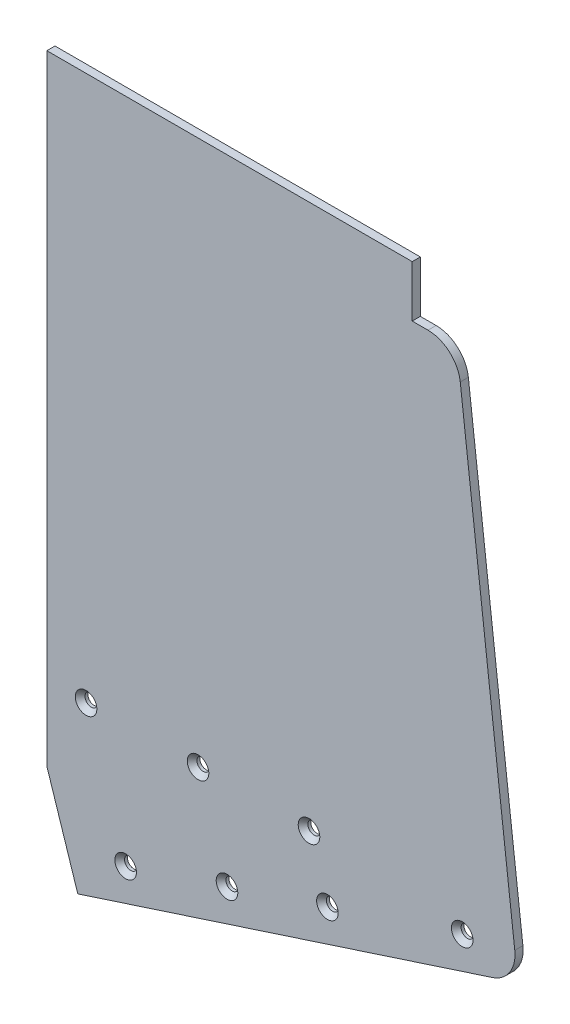
ISO-10303-21;
HEADER;
FILE_DESCRIPTION(('STEP AP214'),'2;1');
FILE_NAME('part.step','',(''),(''),'','','');
FILE_SCHEMA(('AUTOMOTIVE_DESIGN { 1 0 10303 214 1 1 1 1 }'));
ENDSEC;
DATA;
#1=APPLICATION_CONTEXT('core data for automotive mechanical design processes');
#2=APPLICATION_PROTOCOL_DEFINITION('international standard','automotive_design',2000,#1);
#3=PRODUCT_CONTEXT('',#1,'mechanical');
#4=PRODUCT('Part','Part','',(#3));
#5=PRODUCT_RELATED_PRODUCT_CATEGORY('part','',(#4));
#6=PRODUCT_DEFINITION_FORMATION('','',#4);
#7=PRODUCT_DEFINITION_CONTEXT('part definition',#1,'design');
#8=PRODUCT_DEFINITION('design','',#6,#7);
#9=PRODUCT_DEFINITION_SHAPE('','',#8);
#10=(LENGTH_UNIT() NAMED_UNIT(*) SI_UNIT(.MILLI.,.METRE.));
#11=(NAMED_UNIT(*) PLANE_ANGLE_UNIT() SI_UNIT($,.RADIAN.));
#12=(NAMED_UNIT(*) SI_UNIT($,.STERADIAN.) SOLID_ANGLE_UNIT());
#13=UNCERTAINTY_MEASURE_WITH_UNIT(LENGTH_MEASURE(1.E-05),#10,'distance_accuracy_value','');
#14=(GEOMETRIC_REPRESENTATION_CONTEXT(3) GLOBAL_UNCERTAINTY_ASSIGNED_CONTEXT((#13)) GLOBAL_UNIT_ASSIGNED_CONTEXT((#10,
#11,#12)) REPRESENTATION_CONTEXT('',''));
#15=CARTESIAN_POINT('',(0.,0.,0.));
#16=DIRECTION('',(0.,0.,1.));
#17=DIRECTION('',(1.,0.,0.));
#18=AXIS2_PLACEMENT_3D('',#15,#16,#17);
#19=CARTESIAN_POINT('',(-234.75296718065,12.6999999999999,-3.17499999999976));
#20=DIRECTION('',(1.,0.,0.));
#21=DIRECTION('',(0.,1.,0.));
#22=AXIS2_PLACEMENT_3D('',#19,#20,#21);
#23=PLANE('',#22);
#24=DIRECTION('',(0.,-1.,0.));
#25=VECTOR('',#24,1.);
#26=CARTESIAN_POINT('',(-234.75296718065,12.6999999999999,3.33066907387547E-13));
#27=LINE('',#26,#25);
#28=CARTESIAN_POINT('',(-234.75296718065,12.6999999999999,3.33066907387547E-13));
#29=VERTEX_POINT('',#28);
#30=CARTESIAN_POINT('',(-234.75296718065,-229.485553097579,1.66533453693773E-13));
#31=VERTEX_POINT('',#30);
#32=EDGE_CURVE('E120',#29,#31,#27,.T.);
#33=ORIENTED_EDGE('',*,*,#32,.F.);
#34=DIRECTION('',(0.,0.,1.));
#35=VECTOR('',#34,1.);
#36=CARTESIAN_POINT('',(-234.75296718065,12.6999999999999,-3.17499999999976));
#37=LINE('',#36,#35);
#38=CARTESIAN_POINT('',(-234.75296718065,12.6999999999999,-3.17499999999976));
#39=VERTEX_POINT('',#38);
#40=EDGE_CURVE('E147',#39,#29,#37,.T.);
#41=ORIENTED_EDGE('',*,*,#40,.F.);
#42=DIRECTION('',(0.,-1.,0.));
#43=VECTOR('',#42,1.);
#44=CARTESIAN_POINT('',(-234.75296718065,12.6999999999999,-3.17499999999976));
#45=LINE('',#44,#43);
#46=CARTESIAN_POINT('',(-234.75296718065,-229.485553097579,-3.17499999999987));
#47=VERTEX_POINT('',#46);
#48=EDGE_CURVE('E146',#39,#47,#45,.T.);
#49=ORIENTED_EDGE('',*,*,#48,.T.);
#50=DIRECTION('',(0.,0.,-1.));
#51=VECTOR('',#50,1.);
#52=CARTESIAN_POINT('',(-234.75296718065,-229.485553097579,1.66533453693773E-13));
#53=LINE('',#52,#51);
#54=EDGE_CURVE('E128',#31,#47,#53,.T.);
#55=ORIENTED_EDGE('',*,*,#54,.F.);
#56=EDGE_LOOP('',(#33,#41,#49,#55));
#57=FACE_BOUND('',#56,.T.);
#58=ADVANCED_FACE('F43',(#57),#23,.F.);
#59=CARTESIAN_POINT('',(-234.75296718065,-270.542758327657,-3.17499999999993));
#60=DIRECTION('',(-0.309324512684967,0.950956542567645,0.));
#61=DIRECTION('',(-0.950956542567645,-0.309324512684967,0.));
#62=AXIS2_PLACEMENT_3D('',#59,#60,#61);
#63=PLANE('',#62);
#64=DIRECTION('',(0.950956542567645,0.309324512684967,0.));
#65=VECTOR('',#64,1.);
#66=CARTESIAN_POINT('',(-234.75296718065,-270.542758327657,-3.17499999999993));
#67=LINE('',#66,#65);
#68=CARTESIAN_POINT('',(-222.675819090041,-266.614337016557,-3.17499999999987));
#69=VERTEX_POINT('',#68);
#70=CARTESIAN_POINT('',(-60.5974720840385,-213.893940804708,-3.17500000000004));
#71=VERTEX_POINT('',#70);
#72=EDGE_CURVE('E189',#69,#71,#67,.T.);
#73=ORIENTED_EDGE('',*,*,#72,.T.);
#74=DIRECTION('',(0.,0.,1.));
#75=VECTOR('',#74,1.);
#76=CARTESIAN_POINT('',(-60.5974720840385,-213.893940804708,-3.17500000000004));
#77=LINE('',#76,#75);
#78=CARTESIAN_POINT('',(-60.5974720840384,-213.893940804708,0.));
#79=VERTEX_POINT('',#78);
#80=EDGE_CURVE('E11',#79,#71,#77,.F.);
#81=ORIENTED_EDGE('',*,*,#80,.F.);
#82=DIRECTION('',(0.950956542567645,0.309324512684967,0.));
#83=VECTOR('',#82,1.);
#84=CARTESIAN_POINT('',(-234.75296718065,-270.542758327656,0.));
#85=LINE('',#84,#83);
#86=CARTESIAN_POINT('',(-222.675819090041,-266.614337016556,1.66533453693773E-13));
#87=VERTEX_POINT('',#86);
#88=EDGE_CURVE('E117',#87,#79,#85,.T.);
#89=ORIENTED_EDGE('',*,*,#88,.F.);
#90=DIRECTION('',(0.,0.,-1.));
#91=VECTOR('',#90,1.);
#92=CARTESIAN_POINT('',(-222.675819090041,-266.614337016556,1.66533453693773E-13));
#93=LINE('',#92,#91);
#94=EDGE_CURVE('E121',#87,#69,#93,.T.);
#95=ORIENTED_EDGE('',*,*,#94,.T.);
#96=EDGE_LOOP('',(#73,#81,#89,#95));
#97=FACE_BOUND('',#96,.T.);
#98=ADVANCED_FACE('F130',(#97),#63,.F.);
#99=CARTESIAN_POINT('',(-74.5334651306729,-7.41697903189298,-3.17499999999993));
#100=DIRECTION('',(-0.993195579602869,-0.11645832154604,0.));
#101=DIRECTION('',(0.11645832154604,-0.993195579602869,0.));
#102=AXIS2_PLACEMENT_3D('',#99,#100,#101);
#103=PLANE('',#102);
#104=DIRECTION('',(-0.11645832154604,0.993195579602869,0.));
#105=VECTOR('',#104,1.);
#106=CARTESIAN_POINT('',(-74.5334651306728,-7.41697903189276,0.));
#107=LINE('',#106,#105);
#108=CARTESIAN_POINT('',(-51.9123095341809,-200.337772030464,1.66533453693773E-13));
#109=VERTEX_POINT('',#108);
#110=CARTESIAN_POINT('',(-73.2177359388357,-18.6379583482588,0.));
#111=VERTEX_POINT('',#110);
#112=EDGE_CURVE('E131',#109,#111,#107,.T.);
#113=ORIENTED_EDGE('',*,*,#112,.F.);
#114=DIRECTION('',(0.,0.,1.));
#115=VECTOR('',#114,1.);
#116=CARTESIAN_POINT('',(-51.9123095341807,-200.337772030465,-3.17499999999982));
#117=LINE('',#116,#115);
#118=CARTESIAN_POINT('',(-51.9123095341807,-200.337772030465,-3.17499999999982));
#119=VERTEX_POINT('',#118);
#120=EDGE_CURVE('E164',#119,#109,#117,.T.);
#121=ORIENTED_EDGE('',*,*,#120,.F.);
#122=DIRECTION('',(-0.11645832154604,0.993195579602869,0.));
#123=VECTOR('',#122,1.);
#124=CARTESIAN_POINT('',(-74.5334651306729,-7.41697903189298,-3.17499999999993));
#125=LINE('',#124,#123);
#126=CARTESIAN_POINT('',(-73.2177359388355,-18.6379583482585,-3.17500000000004));
#127=VERTEX_POINT('',#126);
#128=EDGE_CURVE('E186',#119,#127,#125,.T.);
#129=ORIENTED_EDGE('',*,*,#128,.T.);
#130=DIRECTION('',(0.,0.,1.));
#131=VECTOR('',#130,1.);
#132=CARTESIAN_POINT('',(-73.2177359388355,-18.6379583482585,-3.17500000000004));
#133=LINE('',#132,#131);
#134=EDGE_CURVE('E167',#111,#127,#133,.F.);
#135=ORIENTED_EDGE('',*,*,#134,.F.);
#136=EDGE_LOOP('',(#113,#121,#129,#135));
#137=FACE_BOUND('',#136,.T.);
#138=ADVANCED_FACE('F284',(#137),#103,.F.);
#139=CARTESIAN_POINT('',(-74.5334651306729,-7.41697903189298,-3.17499999999993));
#140=DIRECTION('',(0.,-1.,0.));
#141=DIRECTION('',(1.,0.,0.));
#142=AXIS2_PLACEMENT_3D('',#139,#140,#141);
#143=PLANE('',#142);
#144=DIRECTION('',(-1.,0.,0.));
#145=VECTOR('',#144,1.);
#146=CARTESIAN_POINT('',(-74.5334651306729,-7.41697903189298,-3.17499999999993));
#147=LINE('',#146,#145);
#148=CARTESIAN_POINT('',(-85.8313197997924,-7.41697903189342,-3.17499999999987));
#149=VERTEX_POINT('',#148);
#150=CARTESIAN_POINT('',(-91.9973273926191,-7.41697903189298,-3.17499999999998));
#151=VERTEX_POINT('',#150);
#152=EDGE_CURVE('E180',#149,#151,#147,.T.);
#153=ORIENTED_EDGE('',*,*,#152,.T.);
#154=DIRECTION('',(0.,0.,1.));
#155=VECTOR('',#154,1.);
#156=CARTESIAN_POINT('',(-91.9973273926191,-7.41697903189298,-3.17499999999998));
#157=LINE('',#156,#155);
#158=CARTESIAN_POINT('',(-91.9973273926189,-7.41697903189298,0.));
#159=VERTEX_POINT('',#158);
#160=EDGE_CURVE('E154',#151,#159,#157,.T.);
#161=ORIENTED_EDGE('',*,*,#160,.T.);
#162=DIRECTION('',(-1.,0.,0.));
#163=VECTOR('',#162,1.);
#164=CARTESIAN_POINT('',(-74.5334651306728,-7.41697903189276,0.));
#165=LINE('',#164,#163);
#166=CARTESIAN_POINT('',(-85.8313197997925,-7.41697903189276,1.66533453693773E-13));
#167=VERTEX_POINT('',#166);
#168=EDGE_CURVE('E134',#167,#159,#165,.T.);
#169=ORIENTED_EDGE('',*,*,#168,.F.);
#170=DIRECTION('',(0.,0.,1.));
#171=VECTOR('',#170,1.);
#172=CARTESIAN_POINT('',(-85.8313197997924,-7.41697903189342,-3.17499999999987));
#173=LINE('',#172,#171);
#174=EDGE_CURVE('E157',#149,#167,#173,.T.);
#175=ORIENTED_EDGE('',*,*,#174,.F.);
#176=EDGE_LOOP('',(#153,#161,#169,#175));
#177=FACE_BOUND('',#176,.T.);
#178=ADVANCED_FACE('F179',(#177),#143,.F.);
#179=CARTESIAN_POINT('',(-91.9973273926191,-7.41697903189298,-3.17499999999998));
#180=DIRECTION('',(-1.,0.,0.));
#181=DIRECTION('',(0.,0.,-1.));
#182=AXIS2_PLACEMENT_3D('',#179,#180,#181);
#183=PLANE('',#182);
#184=DIRECTION('',(0.,1.,0.));
#185=VECTOR('',#184,1.);
#186=CARTESIAN_POINT('',(-91.9973273926189,-7.41697903189298,0.));
#187=LINE('',#186,#185);
#188=CARTESIAN_POINT('',(-91.9973273926188,12.6999999999995,1.66533453693773E-13));
#189=VERTEX_POINT('',#188);
#190=EDGE_CURVE('E141',#159,#189,#187,.T.);
#191=ORIENTED_EDGE('',*,*,#190,.F.);
#192=ORIENTED_EDGE('',*,*,#160,.F.);
#193=DIRECTION('',(0.,1.,0.));
#194=VECTOR('',#193,1.);
#195=CARTESIAN_POINT('',(-91.9973273926191,-7.41697903189298,-3.17499999999998));
#196=LINE('',#195,#194);
#197=CARTESIAN_POINT('',(-91.9973273926184,12.6999999999995,-3.17499999999982));
#198=VERTEX_POINT('',#197);
#199=EDGE_CURVE('E184',#151,#198,#196,.T.);
#200=ORIENTED_EDGE('',*,*,#199,.T.);
#201=DIRECTION('',(0.,0.,1.));
#202=VECTOR('',#201,1.);
#203=CARTESIAN_POINT('',(-91.9973273926184,12.6999999999995,-3.17499999999982));
#204=LINE('',#203,#202);
#205=EDGE_CURVE('E150',#198,#189,#204,.T.);
#206=ORIENTED_EDGE('',*,*,#205,.T.);
#207=EDGE_LOOP('',(#191,#192,#200,#206));
#208=FACE_BOUND('',#207,.T.);
#209=ADVANCED_FACE('F303',(#208),#183,.F.);
#210=CARTESIAN_POINT('',(-234.75296718065,12.6999999999999,-3.17499999999976));
#211=DIRECTION('',(0.,-1.,0.));
#212=DIRECTION('',(1.,0.,0.));
#213=AXIS2_PLACEMENT_3D('',#210,#211,#212);
#214=PLANE('',#213);
#215=DIRECTION('',(-1.,0.,0.));
#216=VECTOR('',#215,1.);
#217=CARTESIAN_POINT('',(-234.75296718065,12.6999999999999,3.33066907387547E-13));
#218=LINE('',#217,#216);
#219=EDGE_CURVE('E144',#189,#29,#218,.T.);
#220=ORIENTED_EDGE('',*,*,#219,.F.);
#221=ORIENTED_EDGE('',*,*,#205,.F.);
#222=DIRECTION('',(-1.,0.,0.));
#223=VECTOR('',#222,1.);
#224=CARTESIAN_POINT('',(-234.75296718065,12.6999999999999,-3.17499999999976));
#225=LINE('',#224,#223);
#226=EDGE_CURVE('E151',#198,#39,#225,.T.);
#227=ORIENTED_EDGE('',*,*,#226,.T.);
#228=ORIENTED_EDGE('',*,*,#40,.T.);
#229=EDGE_LOOP('',(#220,#221,#227,#228));
#230=FACE_BOUND('',#229,.T.);
#231=ADVANCED_FACE('F194',(#230),#214,.F.);
#232=CARTESIAN_POINT('',(0.,0.,-3.17500000000004));
#233=DIRECTION('',(0.,0.,1.));
#234=DIRECTION('',(-1.,0.,0.));
#235=AXIS2_PLACEMENT_3D('',#232,#233,#234);
#236=PLANE('',#235);
#237=CARTESIAN_POINT('',(-203.969823430369,-247.917009556365,-3.17499999999982));
#238=DIRECTION('',(0.,0.,-1.));
#239=DIRECTION('',(-1.,0.,0.));
#240=AXIS2_PLACEMENT_3D('',#237,#238,#239);
#241=CIRCLE('',#240,2.45744999999994);
#242=CARTESIAN_POINT('',(-206.427273430369,-247.917009556365,-3.17499999999982));
#243=VERTEX_POINT('',#242);
#244=EDGE_CURVE('E256',#243,#243,#241,.T.);
#245=ORIENTED_EDGE('',*,*,#244,.F.);
#246=EDGE_LOOP('',(#245));
#247=FACE_BOUND('',#246,.T.);
#248=CARTESIAN_POINT('',(-164.368820636905,-235.035704951385,-3.17499999999987));
#249=DIRECTION('',(0.,0.,-1.));
#250=DIRECTION('',(-1.,0.,0.));
#251=AXIS2_PLACEMENT_3D('',#248,#249,#250);
#252=CIRCLE('',#251,2.45744999999994);
#253=CARTESIAN_POINT('',(-166.826270636905,-235.035704951385,-3.17499999999987));
#254=VERTEX_POINT('',#253);
#255=EDGE_CURVE('E247',#254,#254,#252,.T.);
#256=ORIENTED_EDGE('',*,*,#255,.F.);
#257=EDGE_LOOP('',(#256));
#258=FACE_BOUND('',#257,.T.);
#259=CARTESIAN_POINT('',(-175.687012216855,-200.240181507181,-3.17499999999965));
#260=DIRECTION('',(0.,0.,-1.));
#261=DIRECTION('',(-1.,0.,0.));
#262=AXIS2_PLACEMENT_3D('',#259,#260,#261);
#263=CIRCLE('',#262,2.45744999999994);
#264=CARTESIAN_POINT('',(-178.144462216855,-200.240181507181,-3.17499999999965));
#265=VERTEX_POINT('',#264);
#266=EDGE_CURVE('E238',#265,#265,#263,.T.);
#267=ORIENTED_EDGE('',*,*,#266,.F.);
#268=EDGE_LOOP('',(#267));
#269=FACE_BOUND('',#268,.T.);
#270=CARTESIAN_POINT('',(-219.438787807227,-200.360762709868,-3.17499999999982));
#271=DIRECTION('',(0.,0.,-1.));
#272=DIRECTION('',(-1.,0.,0.));
#273=AXIS2_PLACEMENT_3D('',#270,#271,#272);
#274=CIRCLE('',#273,2.45744999999994);
#275=CARTESIAN_POINT('',(-221.896237807227,-200.360762709868,-3.17499999999982));
#276=VERTEX_POINT('',#275);
#277=EDGE_CURVE('E229',#276,#276,#274,.T.);
#278=ORIENTED_EDGE('',*,*,#277,.F.);
#279=EDGE_LOOP('',(#278));
#280=FACE_BOUND('',#279,.T.);
#281=CARTESIAN_POINT('',(-125.11808934242,-222.268335690299,-3.17499999999982));
#282=DIRECTION('',(0.,0.,-1.));
#283=DIRECTION('',(-1.,0.,0.));
#284=AXIS2_PLACEMENT_3D('',#281,#282,#283);
#285=CIRCLE('',#284,2.45744999999994);
#286=CARTESIAN_POINT('',(-127.57553934242,-222.268335690299,-3.17499999999982));
#287=VERTEX_POINT('',#286);
#288=EDGE_CURVE('E220',#287,#287,#285,.T.);
#289=ORIENTED_EDGE('',*,*,#288,.F.);
#290=EDGE_LOOP('',(#289));
#291=FACE_BOUND('',#290,.T.);
#292=CARTESIAN_POINT('',(-132.322221776819,-200.120666847149,-3.17500000000026));
#293=DIRECTION('',(0.,0.,-1.));
#294=DIRECTION('',(-1.,0.,0.));
#295=AXIS2_PLACEMENT_3D('',#292,#293,#294);
#296=CIRCLE('',#295,2.45744999999994);
#297=CARTESIAN_POINT('',(-134.779671776819,-200.120666847149,-3.17500000000026));
#298=VERTEX_POINT('',#297);
#299=EDGE_CURVE('E211',#298,#298,#296,.T.);
#300=ORIENTED_EDGE('',*,*,#299,.F.);
#301=EDGE_LOOP('',(#300));
#302=FACE_BOUND('',#301,.T.);
#303=CARTESIAN_POINT('',(-72.4520660392008,-205.137277367342,-3.17499999999998));
#304=DIRECTION('',(0.,0.,-1.));
#305=DIRECTION('',(-1.,0.,0.));
#306=AXIS2_PLACEMENT_3D('',#303,#304,#305);
#307=CIRCLE('',#306,2.45744999999994);
#308=CARTESIAN_POINT('',(-74.9095160392007,-205.137277367342,-3.17499999999998));
#309=VERTEX_POINT('',#308);
#310=EDGE_CURVE('E201',#309,#309,#307,.T.);
#311=ORIENTED_EDGE('',*,*,#310,.F.);
#312=EDGE_LOOP('',(#311));
#313=FACE_BOUND('',#312,.T.);
#314=ORIENTED_EDGE('',*,*,#48,.F.);
#315=ORIENTED_EDGE('',*,*,#226,.F.);
#316=ORIENTED_EDGE('',*,*,#199,.F.);
#317=ORIENTED_EDGE('',*,*,#152,.F.);
#318=CARTESIAN_POINT('',(-85.8313197997924,-20.1169790318929,-3.17499999999993));
#319=DIRECTION('',(0.,0.,-1.));
#320=DIRECTION('',(-1.,0.,0.));
#321=AXIS2_PLACEMENT_3D('',#318,#319,#320);
#322=CIRCLE('',#321,12.7);
#323=EDGE_CURVE('E51',#127,#149,#322,.F.);
#324=ORIENTED_EDGE('',*,*,#323,.F.);
#325=ORIENTED_EDGE('',*,*,#128,.F.);
#326=CARTESIAN_POINT('',(-64.5258933951372,-201.816792714098,-3.17499999999993));
#327=DIRECTION('',(0.,0.,-1.));
#328=DIRECTION('',(-1.,0.,0.));
#329=AXIS2_PLACEMENT_3D('',#326,#327,#328);
#330=CIRCLE('',#329,12.7);
#331=EDGE_CURVE('E66',#71,#119,#330,.F.);
#332=ORIENTED_EDGE('',*,*,#331,.F.);
#333=ORIENTED_EDGE('',*,*,#72,.F.);
#334=DIRECTION('',(-0.309324512684967,0.950956542567644,0.));
#335=VECTOR('',#334,1.);
#336=CARTESIAN_POINT('',(-222.675819090041,-266.614337016557,-3.17499999999987));
#337=LINE('',#336,#335);
#338=EDGE_CURVE('E122',#69,#47,#337,.T.);
#339=ORIENTED_EDGE('',*,*,#338,.T.);
#340=EDGE_LOOP('',(#314,#315,#316,#317,#324,#325,#332,#333,#339));
#341=FACE_BOUND('',#340,.T.);
#342=ADVANCED_FACE('F182',(#247,#258,#269,#280,#291,#302,#313,#341),#236,.F.);
#343=CARTESIAN_POINT('',(0.,0.,0.));
#344=DIRECTION('',(0.,0.,1.));
#345=DIRECTION('',(-1.,0.,0.));
#346=AXIS2_PLACEMENT_3D('',#343,#344,#345);
#347=PLANE('',#346);
#348=CARTESIAN_POINT('',(-203.969823430369,-247.917009556365,1.66533453693773E-13));
#349=DIRECTION('',(0.,0.,-1.));
#350=DIRECTION('',(-1.,0.,0.));
#351=AXIS2_PLACEMENT_3D('',#348,#349,#350);
#352=CIRCLE('',#351,4.21640000000001);
#353=CARTESIAN_POINT('',(-208.186223430369,-247.917009556365,1.66533453693774E-13));
#354=VERTEX_POINT('',#353);
#355=EDGE_CURVE('E262',#354,#354,#352,.T.);
#356=ORIENTED_EDGE('',*,*,#355,.T.);
#357=EDGE_LOOP('',(#356));
#358=FACE_BOUND('',#357,.T.);
#359=CARTESIAN_POINT('',(-164.368820636905,-235.035704951384,1.11022302462516E-13));
#360=DIRECTION('',(0.,0.,-1.));
#361=DIRECTION('',(-1.,0.,0.));
#362=AXIS2_PLACEMENT_3D('',#359,#360,#361);
#363=CIRCLE('',#362,4.21640000000001);
#364=CARTESIAN_POINT('',(-168.585220636905,-235.035704951384,1.11022302462516E-13));
#365=VERTEX_POINT('',#364);
#366=EDGE_CURVE('E253',#365,#365,#363,.T.);
#367=ORIENTED_EDGE('',*,*,#366,.T.);
#368=EDGE_LOOP('',(#367));
#369=FACE_BOUND('',#368,.T.);
#370=CARTESIAN_POINT('',(-175.687012216855,-200.240181507181,3.33066907387547E-13));
#371=DIRECTION('',(0.,0.,-1.));
#372=DIRECTION('',(-1.,0.,0.));
#373=AXIS2_PLACEMENT_3D('',#370,#371,#372);
#374=CIRCLE('',#373,4.21640000000001);
#375=CARTESIAN_POINT('',(-179.903412216855,-200.240181507181,3.33066907387547E-13));
#376=VERTEX_POINT('',#375);
#377=EDGE_CURVE('E244',#376,#376,#374,.T.);
#378=ORIENTED_EDGE('',*,*,#377,.T.);
#379=EDGE_LOOP('',(#378));
#380=FACE_BOUND('',#379,.T.);
#381=CARTESIAN_POINT('',(-219.438787807227,-200.360762709867,1.66533453693773E-13));
#382=DIRECTION('',(0.,0.,-1.));
#383=DIRECTION('',(-1.,0.,0.));
#384=AXIS2_PLACEMENT_3D('',#381,#382,#383);
#385=CIRCLE('',#384,4.21640000000001);
#386=CARTESIAN_POINT('',(-223.655187807227,-200.360762709867,1.66533453693774E-13));
#387=VERTEX_POINT('',#386);
#388=EDGE_CURVE('E235',#387,#387,#385,.T.);
#389=ORIENTED_EDGE('',*,*,#388,.T.);
#390=EDGE_LOOP('',(#389));
#391=FACE_BOUND('',#390,.T.);
#392=CARTESIAN_POINT('',(-125.11808934242,-222.268335690299,1.66533453693773E-13));
#393=DIRECTION('',(0.,0.,-1.));
#394=DIRECTION('',(-1.,0.,0.));
#395=AXIS2_PLACEMENT_3D('',#392,#393,#394);
#396=CIRCLE('',#395,4.21639999999999);
#397=CARTESIAN_POINT('',(-129.33448934242,-222.268335690299,1.66533453693774E-13));
#398=VERTEX_POINT('',#397);
#399=EDGE_CURVE('E226',#398,#398,#396,.T.);
#400=ORIENTED_EDGE('',*,*,#399,.T.);
#401=EDGE_LOOP('',(#400));
#402=FACE_BOUND('',#401,.T.);
#403=CARTESIAN_POINT('',(-132.322221776819,-200.120666847149,-2.77555756156289E-13));
#404=DIRECTION('',(0.,0.,-1.));
#405=DIRECTION('',(-1.,0.,0.));
#406=AXIS2_PLACEMENT_3D('',#403,#404,#405);
#407=CIRCLE('',#406,4.21640000000001);
#408=CARTESIAN_POINT('',(-136.538621776819,-200.120666847149,-2.77555756156289E-13));
#409=VERTEX_POINT('',#408);
#410=EDGE_CURVE('E217',#409,#409,#407,.T.);
#411=ORIENTED_EDGE('',*,*,#410,.T.);
#412=EDGE_LOOP('',(#411));
#413=FACE_BOUND('',#412,.T.);
#414=CARTESIAN_POINT('',(-72.4520660392006,-205.137277367342,0.));
#415=DIRECTION('',(0.,0.,-1.));
#416=DIRECTION('',(-1.,0.,0.));
#417=AXIS2_PLACEMENT_3D('',#414,#415,#416);
#418=CIRCLE('',#417,4.21639999999999);
#419=CARTESIAN_POINT('',(-76.6684660392006,-205.137277367342,0.));
#420=VERTEX_POINT('',#419);
#421=EDGE_CURVE('E208',#420,#420,#418,.T.);
#422=ORIENTED_EDGE('',*,*,#421,.T.);
#423=EDGE_LOOP('',(#422));
#424=FACE_BOUND('',#423,.T.);
#425=DIRECTION('',(-0.309324512684967,0.950956542567644,0.));
#426=VECTOR('',#425,1.);
#427=CARTESIAN_POINT('',(-222.675819090041,-266.614337016556,1.66533453693773E-13));
#428=LINE('',#427,#426);
#429=EDGE_CURVE('E58',#87,#31,#428,.T.);
#430=ORIENTED_EDGE('',*,*,#429,.F.);
#431=ORIENTED_EDGE('',*,*,#88,.T.);
#432=CARTESIAN_POINT('',(-64.5258933951373,-201.816792714098,0.));
#433=DIRECTION('',(0.,0.,-1.));
#434=DIRECTION('',(-1.,0.,0.));
#435=AXIS2_PLACEMENT_3D('',#432,#433,#434);
#436=CIRCLE('',#435,12.7);
#437=EDGE_CURVE('E160',#109,#79,#436,.T.);
#438=ORIENTED_EDGE('',*,*,#437,.F.);
#439=ORIENTED_EDGE('',*,*,#112,.T.);
#440=CARTESIAN_POINT('',(-85.8313197997924,-20.1169790318929,0.));
#441=DIRECTION('',(0.,0.,-1.));
#442=DIRECTION('',(-1.,0.,0.));
#443=AXIS2_PLACEMENT_3D('',#440,#441,#442);
#444=CIRCLE('',#443,12.7);
#445=EDGE_CURVE('E162',#167,#111,#444,.T.);
#446=ORIENTED_EDGE('',*,*,#445,.F.);
#447=ORIENTED_EDGE('',*,*,#168,.T.);
#448=ORIENTED_EDGE('',*,*,#190,.T.);
#449=ORIENTED_EDGE('',*,*,#219,.T.);
#450=ORIENTED_EDGE('',*,*,#32,.T.);
#451=EDGE_LOOP('',(#430,#431,#438,#439,#446,#447,#448,#449,#450));
#452=FACE_BOUND('',#451,.T.);
#453=ADVANCED_FACE('F115',(#358,#369,#380,#391,#402,#413,#424,#452),#347,.T.);
#454=CARTESIAN_POINT('',(-85.8313197997924,-20.1169790318929,-3.17499999999993));
#455=DIRECTION('',(0.,0.,1.));
#456=DIRECTION('',(-1.,0.,0.));
#457=AXIS2_PLACEMENT_3D('',#454,#455,#456);
#458=CYLINDRICAL_SURFACE('',#457,12.7);
#459=ORIENTED_EDGE('',*,*,#323,.T.);
#460=ORIENTED_EDGE('',*,*,#174,.T.);
#461=ORIENTED_EDGE('',*,*,#445,.T.);
#462=ORIENTED_EDGE('',*,*,#134,.T.);
#463=EDGE_LOOP('',(#459,#460,#461,#462));
#464=FACE_BOUND('',#463,.T.);
#465=ADVANCED_FACE('F172',(#464),#458,.T.);
#466=CARTESIAN_POINT('',(-64.5258933951372,-201.816792714098,-3.17499999999993));
#467=DIRECTION('',(0.,0.,1.));
#468=DIRECTION('',(-1.,0.,0.));
#469=AXIS2_PLACEMENT_3D('',#466,#467,#468);
#470=CYLINDRICAL_SURFACE('',#469,12.7);
#471=ORIENTED_EDGE('',*,*,#331,.T.);
#472=ORIENTED_EDGE('',*,*,#120,.T.);
#473=ORIENTED_EDGE('',*,*,#437,.T.);
#474=ORIENTED_EDGE('',*,*,#80,.T.);
#475=EDGE_LOOP('',(#471,#472,#473,#474));
#476=FACE_BOUND('',#475,.T.);
#477=ADVANCED_FACE('F45',(#476),#470,.T.);
#478=CARTESIAN_POINT('',(-222.675819090041,-266.614337016556,1.66533453693773E-13));
#479=DIRECTION('',(0.950956542567645,0.309324512684967,0.));
#480=DIRECTION('',(-0.309324512684967,0.950956542567645,0.));
#481=AXIS2_PLACEMENT_3D('',#478,#479,#480);
#482=PLANE('',#481);
#483=ORIENTED_EDGE('',*,*,#338,.F.);
#484=ORIENTED_EDGE('',*,*,#94,.F.);
#485=ORIENTED_EDGE('',*,*,#429,.T.);
#486=ORIENTED_EDGE('',*,*,#54,.T.);
#487=EDGE_LOOP('',(#483,#484,#485,#486));
#488=FACE_BOUND('',#487,.T.);
#489=ADVANCED_FACE('F125',(#488),#482,.F.);
#490=CARTESIAN_POINT('',(-72.4520660392006,-205.137277367342,0.));
#491=DIRECTION('',(0.,0.,1.));
#492=DIRECTION('',(-1.,0.,0.));
#493=AXIS2_PLACEMENT_3D('',#490,#491,#492);
#494=CYLINDRICAL_SURFACE('',#493,2.45744999999994);
#495=ORIENTED_EDGE('',*,*,#310,.T.);
#496=EDGE_LOOP('',(#495));
#497=FACE_BOUND('',#496,.T.);
#498=CARTESIAN_POINT('',(-72.4520660392006,-205.137277367342,-2.02344050988146));
#499=DIRECTION('',(0.,0.,-1.));
#500=DIRECTION('',(-1.,0.,0.));
#501=AXIS2_PLACEMENT_3D('',#498,#499,#500);
#502=CIRCLE('',#501,2.45744999999994);
#503=CARTESIAN_POINT('',(-74.9095160392005,-205.137277367342,-2.02344050988146));
#504=VERTEX_POINT('',#503);
#505=EDGE_CURVE('E205',#504,#504,#502,.T.);
#506=ORIENTED_EDGE('',*,*,#505,.F.);
#507=EDGE_LOOP('',(#506));
#508=FACE_BOUND('',#507,.T.);
#509=ADVANCED_FACE('F359',(#497,#508),#494,.F.);
#510=CARTESIAN_POINT('',(-72.4520660392006,-205.137277367342,0.));
#511=DIRECTION('',(0.,0.,1.));
#512=DIRECTION('',(-1.,0.,0.));
#513=AXIS2_PLACEMENT_3D('',#510,#511,#512);
#514=CONICAL_SURFACE('',#513,4.21639999999999,0.715584993317674);
#515=ORIENTED_EDGE('',*,*,#505,.T.);
#516=EDGE_LOOP('',(#515));
#517=FACE_BOUND('',#516,.T.);
#518=ORIENTED_EDGE('',*,*,#421,.F.);
#519=EDGE_LOOP('',(#518));
#520=FACE_BOUND('',#519,.T.);
#521=ADVANCED_FACE('F367',(#517,#520),#514,.F.);
#522=CARTESIAN_POINT('',(-132.322221776819,-200.120666847149,-2.77555756156289E-13));
#523=DIRECTION('',(0.,0.,1.));
#524=DIRECTION('',(-1.,0.,0.));
#525=AXIS2_PLACEMENT_3D('',#522,#523,#524);
#526=CYLINDRICAL_SURFACE('',#525,2.45744999999994);
#527=ORIENTED_EDGE('',*,*,#299,.T.);
#528=EDGE_LOOP('',(#527));
#529=FACE_BOUND('',#528,.T.);
#530=CARTESIAN_POINT('',(-132.322221776819,-200.120666847149,-2.02344050988174));
#531=DIRECTION('',(0.,0.,-1.));
#532=DIRECTION('',(-1.,0.,0.));
#533=AXIS2_PLACEMENT_3D('',#530,#531,#532);
#534=CIRCLE('',#533,2.45744999999994);
#535=CARTESIAN_POINT('',(-134.779671776819,-200.120666847149,-2.02344050988174));
#536=VERTEX_POINT('',#535);
#537=EDGE_CURVE('E214',#536,#536,#534,.T.);
#538=ORIENTED_EDGE('',*,*,#537,.F.);
#539=EDGE_LOOP('',(#538));
#540=FACE_BOUND('',#539,.T.);
#541=ADVANCED_FACE('F377',(#529,#540),#526,.F.);
#542=CARTESIAN_POINT('',(-132.322221776819,-200.120666847149,-2.77555756156289E-13));
#543=DIRECTION('',(0.,0.,1.));
#544=DIRECTION('',(-1.,0.,0.));
#545=AXIS2_PLACEMENT_3D('',#542,#543,#544);
#546=CONICAL_SURFACE('',#545,4.21640000000001,0.715584993317677);
#547=ORIENTED_EDGE('',*,*,#537,.T.);
#548=EDGE_LOOP('',(#547));
#549=FACE_BOUND('',#548,.T.);
#550=ORIENTED_EDGE('',*,*,#410,.F.);
#551=EDGE_LOOP('',(#550));
#552=FACE_BOUND('',#551,.T.);
#553=ADVANCED_FACE('F387',(#549,#552),#546,.F.);
#554=CARTESIAN_POINT('',(-125.11808934242,-222.268335690299,1.66533453693773E-13));
#555=DIRECTION('',(0.,0.,1.));
#556=DIRECTION('',(-1.,0.,0.));
#557=AXIS2_PLACEMENT_3D('',#554,#555,#556);
#558=CYLINDRICAL_SURFACE('',#557,2.45744999999994);
#559=ORIENTED_EDGE('',*,*,#288,.T.);
#560=EDGE_LOOP('',(#559));
#561=FACE_BOUND('',#560,.T.);
#562=CARTESIAN_POINT('',(-125.11808934242,-222.268335690299,-2.02344050988129));
#563=DIRECTION('',(0.,0.,-1.));
#564=DIRECTION('',(-1.,0.,0.));
#565=AXIS2_PLACEMENT_3D('',#562,#563,#564);
#566=CIRCLE('',#565,2.45744999999994);
#567=CARTESIAN_POINT('',(-127.57553934242,-222.268335690299,-2.02344050988129));
#568=VERTEX_POINT('',#567);
#569=EDGE_CURVE('E223',#568,#568,#566,.T.);
#570=ORIENTED_EDGE('',*,*,#569,.F.);
#571=EDGE_LOOP('',(#570));
#572=FACE_BOUND('',#571,.T.);
#573=ADVANCED_FACE('F397',(#561,#572),#558,.F.);
#574=CARTESIAN_POINT('',(-125.11808934242,-222.268335690299,1.66533453693773E-13));
#575=DIRECTION('',(0.,0.,1.));
#576=DIRECTION('',(-1.,0.,0.));
#577=AXIS2_PLACEMENT_3D('',#574,#575,#576);
#578=CONICAL_SURFACE('',#577,4.21639999999999,0.715584993317674);
#579=ORIENTED_EDGE('',*,*,#569,.T.);
#580=EDGE_LOOP('',(#579));
#581=FACE_BOUND('',#580,.T.);
#582=ORIENTED_EDGE('',*,*,#399,.F.);
#583=EDGE_LOOP('',(#582));
#584=FACE_BOUND('',#583,.T.);
#585=ADVANCED_FACE('F407',(#581,#584),#578,.F.);
#586=CARTESIAN_POINT('',(-219.438787807227,-200.360762709867,1.66533453693773E-13));
#587=DIRECTION('',(0.,0.,1.));
#588=DIRECTION('',(-1.,0.,0.));
#589=AXIS2_PLACEMENT_3D('',#586,#587,#588);
#590=CYLINDRICAL_SURFACE('',#589,2.45744999999994);
#591=ORIENTED_EDGE('',*,*,#277,.T.);
#592=EDGE_LOOP('',(#591));
#593=FACE_BOUND('',#592,.T.);
#594=CARTESIAN_POINT('',(-219.438787807227,-200.360762709868,-2.02344050988129));
#595=DIRECTION('',(0.,0.,-1.));
#596=DIRECTION('',(-1.,0.,0.));
#597=AXIS2_PLACEMENT_3D('',#594,#595,#596);
#598=CIRCLE('',#597,2.45744999999994);
#599=CARTESIAN_POINT('',(-221.896237807227,-200.360762709868,-2.02344050988129));
#600=VERTEX_POINT('',#599);
#601=EDGE_CURVE('E232',#600,#600,#598,.T.);
#602=ORIENTED_EDGE('',*,*,#601,.F.);
#603=EDGE_LOOP('',(#602));
#604=FACE_BOUND('',#603,.T.);
#605=ADVANCED_FACE('F417',(#593,#604),#590,.F.);
#606=CARTESIAN_POINT('',(-219.438787807227,-200.360762709867,1.66533453693773E-13));
#607=DIRECTION('',(0.,0.,1.));
#608=DIRECTION('',(-1.,0.,0.));
#609=AXIS2_PLACEMENT_3D('',#606,#607,#608);
#610=CONICAL_SURFACE('',#609,4.21640000000001,0.715584993317677);
#611=ORIENTED_EDGE('',*,*,#601,.T.);
#612=EDGE_LOOP('',(#611));
#613=FACE_BOUND('',#612,.T.);
#614=ORIENTED_EDGE('',*,*,#388,.F.);
#615=EDGE_LOOP('',(#614));
#616=FACE_BOUND('',#615,.T.);
#617=ADVANCED_FACE('F427',(#613,#616),#610,.F.);
#618=CARTESIAN_POINT('',(-175.687012216855,-200.240181507181,3.33066907387547E-13));
#619=DIRECTION('',(0.,0.,1.));
#620=DIRECTION('',(-1.,0.,0.));
#621=AXIS2_PLACEMENT_3D('',#618,#619,#620);
#622=CYLINDRICAL_SURFACE('',#621,2.45744999999994);
#623=ORIENTED_EDGE('',*,*,#266,.T.);
#624=EDGE_LOOP('',(#623));
#625=FACE_BOUND('',#624,.T.);
#626=CARTESIAN_POINT('',(-175.687012216855,-200.240181507181,-2.02344050988112));
#627=DIRECTION('',(0.,0.,-1.));
#628=DIRECTION('',(-1.,0.,0.));
#629=AXIS2_PLACEMENT_3D('',#626,#627,#628);
#630=CIRCLE('',#629,2.45744999999994);
#631=CARTESIAN_POINT('',(-178.144462216855,-200.240181507181,-2.02344050988112));
#632=VERTEX_POINT('',#631);
#633=EDGE_CURVE('E241',#632,#632,#630,.T.);
#634=ORIENTED_EDGE('',*,*,#633,.F.);
#635=EDGE_LOOP('',(#634));
#636=FACE_BOUND('',#635,.T.);
#637=ADVANCED_FACE('F437',(#625,#636),#622,.F.);
#638=CARTESIAN_POINT('',(-175.687012216855,-200.240181507181,3.33066907387547E-13));
#639=DIRECTION('',(0.,0.,1.));
#640=DIRECTION('',(-1.,0.,0.));
#641=AXIS2_PLACEMENT_3D('',#638,#639,#640);
#642=CONICAL_SURFACE('',#641,4.21640000000001,0.715584993317677);
#643=ORIENTED_EDGE('',*,*,#633,.T.);
#644=EDGE_LOOP('',(#643));
#645=FACE_BOUND('',#644,.T.);
#646=ORIENTED_EDGE('',*,*,#377,.F.);
#647=EDGE_LOOP('',(#646));
#648=FACE_BOUND('',#647,.T.);
#649=ADVANCED_FACE('F447',(#645,#648),#642,.F.);
#650=CARTESIAN_POINT('',(-164.368820636905,-235.035704951384,1.11022302462516E-13));
#651=DIRECTION('',(0.,0.,1.));
#652=DIRECTION('',(-1.,0.,0.));
#653=AXIS2_PLACEMENT_3D('',#650,#651,#652);
#654=CYLINDRICAL_SURFACE('',#653,2.45744999999994);
#655=ORIENTED_EDGE('',*,*,#255,.T.);
#656=EDGE_LOOP('',(#655));
#657=FACE_BOUND('',#656,.T.);
#658=CARTESIAN_POINT('',(-164.368820636905,-235.035704951384,-2.02344050988135));
#659=DIRECTION('',(0.,0.,-1.));
#660=DIRECTION('',(-1.,0.,0.));
#661=AXIS2_PLACEMENT_3D('',#658,#659,#660);
#662=CIRCLE('',#661,2.45744999999994);
#663=CARTESIAN_POINT('',(-166.826270636905,-235.035704951384,-2.02344050988135));
#664=VERTEX_POINT('',#663);
#665=EDGE_CURVE('E250',#664,#664,#662,.T.);
#666=ORIENTED_EDGE('',*,*,#665,.F.);
#667=EDGE_LOOP('',(#666));
#668=FACE_BOUND('',#667,.T.);
#669=ADVANCED_FACE('F457',(#657,#668),#654,.F.);
#670=CARTESIAN_POINT('',(-164.368820636905,-235.035704951384,1.11022302462516E-13));
#671=DIRECTION('',(0.,0.,1.));
#672=DIRECTION('',(-1.,0.,0.));
#673=AXIS2_PLACEMENT_3D('',#670,#671,#672);
#674=CONICAL_SURFACE('',#673,4.21640000000001,0.715584993317677);
#675=ORIENTED_EDGE('',*,*,#665,.T.);
#676=EDGE_LOOP('',(#675));
#677=FACE_BOUND('',#676,.T.);
#678=ORIENTED_EDGE('',*,*,#366,.F.);
#679=EDGE_LOOP('',(#678));
#680=FACE_BOUND('',#679,.T.);
#681=ADVANCED_FACE('F276',(#677,#680),#674,.F.);
#682=CARTESIAN_POINT('',(-203.969823430369,-247.917009556365,1.66533453693773E-13));
#683=DIRECTION('',(0.,0.,1.));
#684=DIRECTION('',(-1.,0.,0.));
#685=AXIS2_PLACEMENT_3D('',#682,#683,#684);
#686=CYLINDRICAL_SURFACE('',#685,2.45744999999994);
#687=ORIENTED_EDGE('',*,*,#244,.T.);
#688=EDGE_LOOP('',(#687));
#689=FACE_BOUND('',#688,.T.);
#690=CARTESIAN_POINT('',(-203.969823430369,-247.917009556365,-2.02344050988129));
#691=DIRECTION('',(0.,0.,-1.));
#692=DIRECTION('',(-1.,0.,0.));
#693=AXIS2_PLACEMENT_3D('',#690,#691,#692);
#694=CIRCLE('',#693,2.45744999999994);
#695=CARTESIAN_POINT('',(-206.427273430369,-247.917009556365,-2.02344050988129));
#696=VERTEX_POINT('',#695);
#697=EDGE_CURVE('E259',#696,#696,#694,.T.);
#698=ORIENTED_EDGE('',*,*,#697,.F.);
#699=EDGE_LOOP('',(#698));
#700=FACE_BOUND('',#699,.T.);
#701=ADVANCED_FACE('F270',(#689,#700),#686,.F.);
#702=CARTESIAN_POINT('',(-203.969823430369,-247.917009556365,1.66533453693773E-13));
#703=DIRECTION('',(0.,0.,1.));
#704=DIRECTION('',(-1.,0.,0.));
#705=AXIS2_PLACEMENT_3D('',#702,#703,#704);
#706=CONICAL_SURFACE('',#705,4.21640000000001,0.715584993317677);
#707=ORIENTED_EDGE('',*,*,#697,.T.);
#708=EDGE_LOOP('',(#707));
#709=FACE_BOUND('',#708,.T.);
#710=ORIENTED_EDGE('',*,*,#355,.F.);
#711=EDGE_LOOP('',(#710));
#712=FACE_BOUND('',#711,.T.);
#713=ADVANCED_FACE('F268',(#709,#712),#706,.F.);
#714=CLOSED_SHELL('',(#58,#98,#138,#178,#209,#231,#342,#453,#465,#477,#489,#509,#521,#541,#553,
#573,#585,#605,#617,#637,#649,#669,#681,#701,#713));
#715=MANIFOLD_SOLID_BREP('B2',#714);
#716=ADVANCED_BREP_SHAPE_REPRESENTATION('',(#18,#715),#14);
#717=SHAPE_DEFINITION_REPRESENTATION(#9,#716);
ENDSEC;
END-ISO-10303-21;
